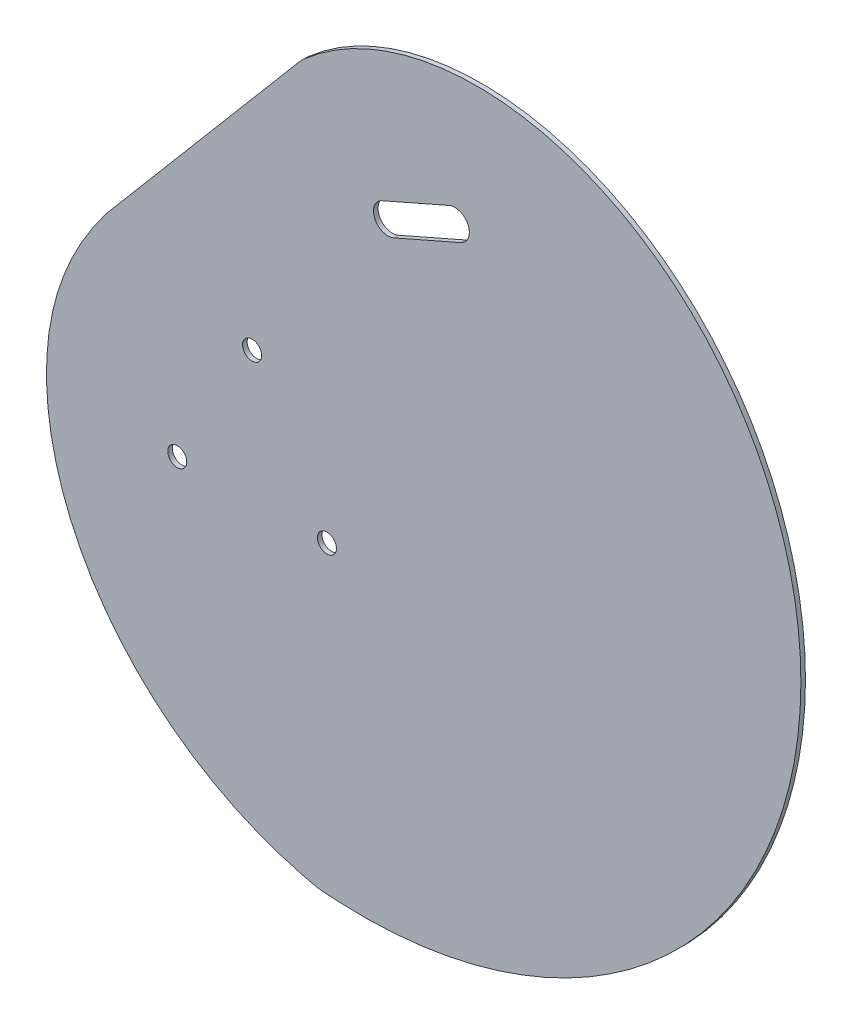
ISO-10303-21;
HEADER;
FILE_DESCRIPTION(('STEP AP214'),'2;1');
FILE_NAME('part.step','',(''),(''),'','','');
FILE_SCHEMA(('AUTOMOTIVE_DESIGN { 1 0 10303 214 1 1 1 1 }'));
ENDSEC;
DATA;
#1=APPLICATION_CONTEXT('core data for automotive mechanical design processes');
#2=APPLICATION_PROTOCOL_DEFINITION('international standard','automotive_design',2000,#1);
#3=PRODUCT_CONTEXT('',#1,'mechanical');
#4=PRODUCT('Part','Part','',(#3));
#5=PRODUCT_RELATED_PRODUCT_CATEGORY('part','',(#4));
#6=PRODUCT_DEFINITION_FORMATION('','',#4);
#7=PRODUCT_DEFINITION_CONTEXT('part definition',#1,'design');
#8=PRODUCT_DEFINITION('design','',#6,#7);
#9=PRODUCT_DEFINITION_SHAPE('','',#8);
#10=(LENGTH_UNIT() NAMED_UNIT(*) SI_UNIT(.MILLI.,.METRE.));
#11=(NAMED_UNIT(*) PLANE_ANGLE_UNIT() SI_UNIT($,.RADIAN.));
#12=(NAMED_UNIT(*) SI_UNIT($,.STERADIAN.) SOLID_ANGLE_UNIT());
#13=UNCERTAINTY_MEASURE_WITH_UNIT(LENGTH_MEASURE(1.E-05),#10,'distance_accuracy_value','');
#14=(GEOMETRIC_REPRESENTATION_CONTEXT(3) GLOBAL_UNCERTAINTY_ASSIGNED_CONTEXT((#13)) GLOBAL_UNIT_ASSIGNED_CONTEXT((#10,
#11,#12)) REPRESENTATION_CONTEXT('',''));
#15=CARTESIAN_POINT('',(0.,0.,0.));
#16=DIRECTION('',(0.,0.,1.));
#17=DIRECTION('',(1.,0.,0.));
#18=AXIS2_PLACEMENT_3D('',#15,#16,#17);
#19=CARTESIAN_POINT('',(0.,0.,0.396875));
#20=DIRECTION('',(0.,0.,1.));
#21=DIRECTION('',(1.,0.,0.));
#22=AXIS2_PLACEMENT_3D('',#19,#20,#21);
#23=PLANE('',#22);
#24=CARTESIAN_POINT('',(-12.5939001772955,-1.27258597502269,0.396875000000001));
#25=DIRECTION('',(0.,0.,1.));
#26=DIRECTION('',(1.,0.,0.));
#27=AXIS2_PLACEMENT_3D('',#24,#25,#26);
#28=CIRCLE('',#27,1.64999999999999);
#29=CARTESIAN_POINT('',(-10.9439001772955,-1.27258597502269,0.396875000000001));
#30=VERTEX_POINT('',#29);
#31=EDGE_CURVE('E114',#30,#30,#28,.T.);
#32=ORIENTED_EDGE('',*,*,#31,.F.);
#33=EDGE_LOOP('',(#32));
#34=FACE_BOUND('',#33,.T.);
#35=CARTESIAN_POINT('',(0.396480879471766,-23.7725859750223,0.396875000000001));
#36=DIRECTION('',(0.,0.,1.));
#37=DIRECTION('',(1.,0.,0.));
#38=AXIS2_PLACEMENT_3D('',#35,#36,#37);
#39=CIRCLE('',#38,1.64999999999999);
#40=CARTESIAN_POINT('',(2.04648087947175,-23.7725859750223,0.396875000000001));
#41=VERTEX_POINT('',#40);
#42=EDGE_CURVE('E157',#41,#41,#39,.T.);
#43=ORIENTED_EDGE('',*,*,#42,.F.);
#44=EDGE_LOOP('',(#43));
#45=FACE_BOUND('',#44,.T.);
#46=CARTESIAN_POINT('',(-25.5842812340614,-23.7725859750231,0.396875000000001));
#47=DIRECTION('',(0.,0.,1.));
#48=DIRECTION('',(1.,0.,0.));
#49=AXIS2_PLACEMENT_3D('',#46,#47,#48);
#50=CIRCLE('',#49,1.64999999999999);
#51=CARTESIAN_POINT('',(-23.9342812340614,-23.7725859750231,0.396875000000001));
#52=VERTEX_POINT('',#51);
#53=EDGE_CURVE('E164',#52,#52,#50,.T.);
#54=ORIENTED_EDGE('',*,*,#53,.F.);
#55=EDGE_LOOP('',(#54));
#56=FACE_BOUND('',#55,.T.);
#57=CARTESIAN_POINT('',(-1.26128431869605,-76.3889966640853,0.396875));
#58=CARTESIAN_POINT('',(-0.976706935574322,-76.433000958118,0.396875));
#59=CARTESIAN_POINT('',(-0.40570033732491,-76.5002886734785,0.396875));
#60=CARTESIAN_POINT('',(0.205282970299483,-76.5431286550552,0.396875));
#61=CARTESIAN_POINT('',(0.635947632892369,-76.5659234882829,0.396875));
#62=CARTESIAN_POINT('',(0.943803395898629,-76.5837536992732,0.396875));
#63=CARTESIAN_POINT('',(1.51657766798327,-76.6253526449032,0.396875));
#64=CARTESIAN_POINT('',(2.39472861708088,-76.6794226518138,0.396875));
#65=CARTESIAN_POINT('',(3.1808192769605,-76.7137003743502,0.396875));
#66=CARTESIAN_POINT('',(4.19803699961454,-76.75168724619,0.396875));
#67=CARTESIAN_POINT('',(6.0521406389918,-76.7942720929503,0.396875));
#68=CARTESIAN_POINT('',(8.65531896727179,-76.7757899651055,0.396875));
#69=CARTESIAN_POINT('',(11.7992302850273,-76.631186753929,0.396875));
#70=CARTESIAN_POINT('',(14.9308116076091,-76.362150817123,0.396875));
#71=CARTESIAN_POINT('',(19.0927292822368,-75.8376989684194,0.396875));
#72=CARTESIAN_POINT('',(24.2526003043896,-74.8709042385839,0.396875));
#73=CARTESIAN_POINT('',(30.3366917936986,-73.2151665179252,0.396875));
#74=CARTESIAN_POINT('',(38.2496377184228,-70.3553029330726,0.396875));
#75=CARTESIAN_POINT('',(47.6646576679233,-65.5807106727296,0.396875));
#76=CARTESIAN_POINT('',(57.8782405742599,-58.0526588499173,0.396875));
#77=CARTESIAN_POINT('',(69.6472472290832,-45.8604490127679,0.396875));
#78=CARTESIAN_POINT('',(80.1730162895738,-27.1334514768673,0.396875));
#79=CARTESIAN_POINT('',(84.2538630410436,-1.50479165459522,0.396875));
#80=CARTESIAN_POINT('',(79.5599947434369,19.8412067482863,0.396875));
#81=CARTESIAN_POINT('',(70.8796865135484,34.9401638956233,0.396875));
#82=CARTESIAN_POINT('',(62.021642873432,44.7053655266334,0.396875));
#83=CARTESIAN_POINT('',(51.0907411074019,52.2640812116842,0.396875));
#84=CARTESIAN_POINT('',(38.576471746608,57.0540859282341,0.396875));
#85=CARTESIAN_POINT('',(25.1004774931715,58.5603822983813,0.396875));
#86=CARTESIAN_POINT('',(13.7708368946147,56.6943293928139,0.396875));
#87=CARTESIAN_POINT('',(5.22574400857566,53.179291685644,0.396875));
#88=CARTESIAN_POINT('',(-0.75748548654271,49.5274645181489,0.396875));
#89=CARTESIAN_POINT('',(-5.17982564226412,45.6481332259453,0.396875));
#90=CARTESIAN_POINT('',(-8.21712868273601,42.3111233056651,0.396875));
#91=CARTESIAN_POINT('',(-10.2837476793927,39.7285564460287,0.396875));
#92=CARTESIAN_POINT('',(-12.1453981413637,37.1299230221057,0.396875));
#93=CARTESIAN_POINT('',(-13.803593656072,34.6302202411006,0.396875));
#94=CARTESIAN_POINT('',(-15.0263666385234,32.7872172676154,0.396875));
#95=CARTESIAN_POINT('',(-15.757749026262,31.8150435741405,0.396875));
#96=CARTESIAN_POINT('',(-16.4572837085939,31.0087975471452,0.396875));
#97=CARTESIAN_POINT('',(-17.3148530430872,30.2124256121384,0.396875));
#98=CARTESIAN_POINT('',(-18.8320987171928,29.1405411562789,0.396875));
#99=CARTESIAN_POINT('',(-20.5794335453912,27.9210149954297,0.396875));
#100=CARTESIAN_POINT('',(-21.8514483213816,26.9528121584477,0.396875));
#101=CARTESIAN_POINT('',(-22.9229134864311,26.0255763335065,0.396875));
#102=CARTESIAN_POINT('',(-23.9113330049711,25.0957745743073,0.396875));
#103=CARTESIAN_POINT('',(-25.0438847891512,23.9057178105531,0.396875));
#104=CARTESIAN_POINT('',(-26.2444451597005,22.4769501418682,0.396875));
#105=CARTESIAN_POINT('',(-27.6678771544237,20.6032078316902,0.396875));
#106=CARTESIAN_POINT('',(-29.1662720153948,18.3817060593167,0.396875));
#107=CARTESIAN_POINT('',(-30.6820035254275,16.0304898055358,0.396875));
#108=CARTESIAN_POINT('',(-31.8417450158577,14.3234191557175,0.396875));
#109=CARTESIAN_POINT('',(-32.7929265221825,13.0258719381619,0.396875));
#110=CARTESIAN_POINT('',(-33.7609917005133,11.7717771176703,0.396875));
#111=CARTESIAN_POINT('',(-35.1935179417244,10.0318274989824,0.396875));
#112=CARTESIAN_POINT('',(-37.0947743542895,7.68858611063458,0.396875));
#113=CARTESIAN_POINT('',(-39.6505131759334,4.30610185058949,0.396875));
#114=CARTESIAN_POINT('',(-42.6514237523282,-0.366044153239744,0.396875));
#115=CARTESIAN_POINT('',(-45.5355557594005,-6.54725137287064,0.396875));
#116=CARTESIAN_POINT('',(-47.5029702487626,-13.2116577754802,0.396875));
#117=CARTESIAN_POINT('',(-48.6844974640878,-22.3699096817478,0.396875));
#118=CARTESIAN_POINT('',(-47.6098868039418,-33.7322087237693,0.396875));
#119=CARTESIAN_POINT('',(-42.8642408139455,-46.3451326435725,0.396875));
#120=CARTESIAN_POINT('',(-36.5641298213063,-55.4680273522898,0.396875));
#121=CARTESIAN_POINT('',(-30.4296575788591,-61.7275262732319,0.396875));
#122=CARTESIAN_POINT('',(-25.3568115028753,-65.8672301951248,0.396875));
#123=CARTESIAN_POINT('',(-20.7978951820845,-68.8298585097831,0.396875));
#124=CARTESIAN_POINT('',(-16.9868888228126,-70.8972783811654,0.396875));
#125=CARTESIAN_POINT('',(-14.0571261532245,-72.2940624730244,0.396875));
#126=CARTESIAN_POINT('',(-11.0574897827893,-73.537247470639,0.396875));
#127=CARTESIAN_POINT('',(-8.52863978148638,-74.4382486629739,0.396875));
#128=CARTESIAN_POINT('',(-6.7053553577977,-75.0088395123344,0.396875));
#129=CARTESIAN_POINT('',(-5.69991861950379,-75.3033007427362,0.396875));
#130=CARTESIAN_POINT('',(-4.91466346108121,-75.5253296610727,0.396875));
#131=CARTESIAN_POINT('',(-4.04372816904597,-75.7517503026063,0.396875));
#132=CARTESIAN_POINT('',(-3.47701846483031,-75.8911528901832,0.396875));
#133=CARTESIAN_POINT('',(-3.15620305968882,-75.9746877031505,0.396875));
#134=CARTESIAN_POINT('',(-2.71872815087296,-76.0895979552755,0.396875));
#135=CARTESIAN_POINT('',(-2.11316463605528,-76.2362629092826,0.396875));
#136=CARTESIAN_POINT('',(-1.54586170181775,-76.3449923700527,0.396875));
#137=CARTESIAN_POINT('',(-1.26128431869605,-76.3889966640853,0.396875));
#138=B_SPLINE_CURVE_WITH_KNOTS('',3,(#57,#58,#59,#60,#61,#62,#63,#64,#65,#66,#67,#68,#69,#70,
#71,#72,#73,#74,#75,#76,#77,#78,#79,#80,#81,#82,#83,#84,#85,#86,#87,#88,#89,#90,#91,#92,#93,#94,
#95,#96,#97,#98,#99,#100,#101,#102,#103,#104,#105,#106,#107,#108,#109,#110,#111,#112,#113,#114,
#115,#116,#117,#118,#119,#120,#121,#122,#123,#124,#125,#126,#127,#128,#129,#130,#131,#132,#133,
#134,#135,#136,#137),.UNSPECIFIED.,.T.,.F.,(4,1,1,1,1,1,1,1,1,1,1,1,1,1,1,1,1,1,1,1,1,1,1,1,1,1,
1,1,1,1,1,1,1,1,1,1,1,1,1,1,1,1,1,1,1,1,1,1,1,1,1,1,1,1,1,1,1,1,1,1,1,1,1,1,1,1,1,1,1,1,1,1,1,1,
1,1,1,1,4),(0.,0.0009765625,0.001953125,0.0029296875,0.00390625,0.005859375,0.0078125,
0.009765625,0.01171875,0.015625,0.0234375,0.03125,0.0390625,0.046875,0.0625,0.078125,0.09375,
0.125,0.15625,0.1875,0.25,0.3125,0.375,0.40625,0.4375,0.46875,0.5,0.53125,0.5625,0.578125,
0.59375,0.609375,0.6171875,0.625,0.6328125,0.640625,0.6484375,0.65234375,0.65625,0.6640625,
0.671875,0.67578125,0.6796875,0.681640625,0.68359375,0.6875,0.69140625,0.6953125,0.703125,
0.7109375,0.71875,0.72265625,0.7265625,0.734375,0.7421875,0.75,0.765625,0.78125,0.796875,0.8125,
0.84375,0.875,0.90625,0.921875,0.9375,0.953125,0.9609375,0.96875,0.9765625,0.984375,0.98828125,
0.990234375,0.9921875,0.994140625,0.99609375,0.9970703125,0.998046875,0.9990234375,1.),.UNSPECIFIED.);
#139=CARTESIAN_POINT('',(-37.9799857120954,6.50792390325195,0.396875));
#140=VERTEX_POINT('',#139);
#141=CARTESIAN_POINT('',(-3.53695857470606,47.0282576025844,0.396875));
#142=VERTEX_POINT('',#141);
#143=EDGE_CURVE('E179',#140,#142,#138,.T.);
#144=ORIENTED_EDGE('',*,*,#143,.T.);
#145=CARTESIAN_POINT('',(3.06845796283441,39.5203635992312,0.396875));
#146=DIRECTION('',(0.,0.,1.));
#147=DIRECTION('',(1.,0.,0.));
#148=AXIS2_PLACEMENT_3D('',#145,#146,#147);
#149=CIRCLE('',#148,10.);
#150=CARTESIAN_POINT('',(-4.56394467477297,45.9815113283459,0.396875));
#151=VERTEX_POINT('',#150);
#152=EDGE_CURVE('E197',#142,#151,#149,.T.);
#153=ORIENTED_EDGE('',*,*,#152,.T.);
#154=DIRECTION('',(0.64611477291147,0.763240263760737,0.));
#155=VECTOR('',#154,1.);
#156=CARTESIAN_POINT('',(-4.11931026186588,46.506747556973,0.396875));
#157=LINE('',#156,#155);
#158=EDGE_CURVE('E171',#140,#151,#157,.T.);
#159=ORIENTED_EDGE('',*,*,#158,.F.);
#160=EDGE_LOOP('',(#144,#153,#159));
#161=FACE_BOUND('',#160,.T.);
#162=DIRECTION('',(0.915739274242188,0.401773047391671,0.));
#163=VECTOR('',#162,1.);
#164=CARTESIAN_POINT('',(11.9849141806537,27.8957335836621,0.396875000000001));
#165=LINE('',#164,#163);
#166=CARTESIAN_POINT('',(11.9849141806537,27.8957335836621,0.396875000000001));
#167=VERTEX_POINT('',#166);
#168=CARTESIAN_POINT('',(23.6148029635294,32.9982512855363,0.396875000000001));
#169=VERTEX_POINT('',#168);
#170=EDGE_CURVE('E106',#167,#169,#165,.T.);
#171=ORIENTED_EDGE('',*,*,#170,.F.);
#172=CARTESIAN_POINT('',(10.9804815621745,30.1850817692675,0.396875000000001));
#173=DIRECTION('',(0.,0.,1.));
#174=DIRECTION('',(1.,0.,0.));
#175=AXIS2_PLACEMENT_3D('',#172,#173,#174);
#176=CIRCLE('',#175,2.5);
#177=CARTESIAN_POINT('',(9.97604894369531,32.474429954873,0.396875000000001));
#178=VERTEX_POINT('',#177);
#179=EDGE_CURVE('E97',#178,#167,#176,.T.);
#180=ORIENTED_EDGE('',*,*,#179,.F.);
#181=DIRECTION('',(-0.915739274242188,-0.401773047391673,0.));
#182=VECTOR('',#181,1.);
#183=CARTESIAN_POINT('',(9.97604894369531,32.474429954873,0.396875000000001));
#184=LINE('',#183,#182);
#185=CARTESIAN_POINT('',(21.6059377265711,37.5769476567472,0.396875));
#186=VERTEX_POINT('',#185);
#187=EDGE_CURVE('E123',#186,#178,#184,.T.);
#188=ORIENTED_EDGE('',*,*,#187,.F.);
#189=CARTESIAN_POINT('',(22.6103703450502,35.2875994711417,0.396875000000001));
#190=DIRECTION('',(0.,0.,1.));
#191=DIRECTION('',(1.,0.,0.));
#192=AXIS2_PLACEMENT_3D('',#189,#190,#191);
#193=CIRCLE('',#192,2.50000000000002);
#194=EDGE_CURVE('E118',#169,#186,#193,.T.);
#195=ORIENTED_EDGE('',*,*,#194,.F.);
#196=EDGE_LOOP('',(#171,#180,#188,#195));
#197=FACE_BOUND('',#196,.T.);
#198=ADVANCED_FACE('F39',(#34,#45,#56,#161,#197),#23,.T.);
#199=CARTESIAN_POINT('',(0.,0.,-0.396875));
#200=DIRECTION('',(0.,0.,1.));
#201=DIRECTION('',(1.,0.,0.));
#202=AXIS2_PLACEMENT_3D('',#199,#200,#201);
#203=PLANE('',#202);
#204=DIRECTION('',(0.64611477291147,0.763240263760737,0.));
#205=VECTOR('',#204,1.);
#206=CARTESIAN_POINT('',(-25.3340204344462,21.4463068015867,-0.396875));
#207=LINE('',#206,#205);
#208=CARTESIAN_POINT('',(-37.9799857120954,6.50792390325195,-0.396875));
#209=VERTEX_POINT('',#208);
#210=CARTESIAN_POINT('',(-4.56394467477297,45.9815113283459,-0.396875));
#211=VERTEX_POINT('',#210);
#212=EDGE_CURVE('E186',#209,#211,#207,.T.);
#213=ORIENTED_EDGE('',*,*,#212,.T.);
#214=CARTESIAN_POINT('',(3.06845796283441,39.5203635992312,-0.396875));
#215=DIRECTION('',(0.,0.,1.));
#216=DIRECTION('',(1.,0.,0.));
#217=AXIS2_PLACEMENT_3D('',#214,#215,#216);
#218=CIRCLE('',#217,10.);
#219=CARTESIAN_POINT('',(-3.53695857470606,47.0282576025844,-0.396875));
#220=VERTEX_POINT('',#219);
#221=EDGE_CURVE('E12',#211,#220,#218,.F.);
#222=ORIENTED_EDGE('',*,*,#221,.T.);
#223=CARTESIAN_POINT('',(-1.26128431869605,-76.3889966640853,-0.396875));
#224=CARTESIAN_POINT('',(-0.976706935574322,-76.433000958118,-0.396875));
#225=CARTESIAN_POINT('',(-0.40570033732491,-76.5002886734785,-0.396875));
#226=CARTESIAN_POINT('',(0.205282970299483,-76.5431286550552,-0.396875));
#227=CARTESIAN_POINT('',(0.635947632892369,-76.5659234882829,-0.396875));
#228=CARTESIAN_POINT('',(0.943803395898629,-76.5837536992732,-0.396875));
#229=CARTESIAN_POINT('',(1.51657766798327,-76.6253526449032,-0.396875));
#230=CARTESIAN_POINT('',(2.39472861708088,-76.6794226518138,-0.396875));
#231=CARTESIAN_POINT('',(3.1808192769605,-76.7137003743502,-0.396875));
#232=CARTESIAN_POINT('',(4.19803699961454,-76.75168724619,-0.396875));
#233=CARTESIAN_POINT('',(6.0521406389918,-76.7942720929503,-0.396875));
#234=CARTESIAN_POINT('',(8.65531896727179,-76.7757899651055,-0.396875));
#235=CARTESIAN_POINT('',(11.7992302850273,-76.631186753929,-0.396875));
#236=CARTESIAN_POINT('',(14.9308116076091,-76.362150817123,-0.396875));
#237=CARTESIAN_POINT('',(19.0927292822368,-75.8376989684194,-0.396875));
#238=CARTESIAN_POINT('',(24.2526003043896,-74.8709042385839,-0.396875));
#239=CARTESIAN_POINT('',(30.3366917936986,-73.2151665179252,-0.396875));
#240=CARTESIAN_POINT('',(38.2496377184228,-70.3553029330726,-0.396875));
#241=CARTESIAN_POINT('',(47.6646576679233,-65.5807106727296,-0.396875));
#242=CARTESIAN_POINT('',(57.8782405742599,-58.0526588499173,-0.396875));
#243=CARTESIAN_POINT('',(69.6472472290832,-45.8604490127679,-0.396875));
#244=CARTESIAN_POINT('',(80.1730162895738,-27.1334514768673,-0.396875));
#245=CARTESIAN_POINT('',(84.2538630410436,-1.50479165459522,-0.396875));
#246=CARTESIAN_POINT('',(79.5599947434369,19.8412067482863,-0.396875));
#247=CARTESIAN_POINT('',(70.8796865135484,34.9401638956233,-0.396875));
#248=CARTESIAN_POINT('',(62.021642873432,44.7053655266334,-0.396875));
#249=CARTESIAN_POINT('',(51.0907411074019,52.2640812116842,-0.396875));
#250=CARTESIAN_POINT('',(38.576471746608,57.0540859282341,-0.396875));
#251=CARTESIAN_POINT('',(25.1004774931715,58.5603822983813,-0.396875));
#252=CARTESIAN_POINT('',(13.7708368946147,56.6943293928139,-0.396875));
#253=CARTESIAN_POINT('',(5.22574400857566,53.179291685644,-0.396875));
#254=CARTESIAN_POINT('',(-0.75748548654271,49.5274645181489,-0.396875));
#255=CARTESIAN_POINT('',(-5.17982564226412,45.6481332259453,-0.396875));
#256=CARTESIAN_POINT('',(-8.21712868273601,42.3111233056651,-0.396875));
#257=CARTESIAN_POINT('',(-10.2837476793927,39.7285564460287,-0.396875));
#258=CARTESIAN_POINT('',(-12.1453981413637,37.1299230221057,-0.396875));
#259=CARTESIAN_POINT('',(-13.803593656072,34.6302202411006,-0.396875));
#260=CARTESIAN_POINT('',(-15.0263666385234,32.7872172676154,-0.396875));
#261=CARTESIAN_POINT('',(-15.757749026262,31.8150435741405,-0.396875));
#262=CARTESIAN_POINT('',(-16.4572837085939,31.0087975471452,-0.396875));
#263=CARTESIAN_POINT('',(-17.3148530430872,30.2124256121384,-0.396875));
#264=CARTESIAN_POINT('',(-18.8320987171928,29.1405411562789,-0.396875));
#265=CARTESIAN_POINT('',(-20.5794335453912,27.9210149954297,-0.396875));
#266=CARTESIAN_POINT('',(-21.8514483213816,26.9528121584477,-0.396875));
#267=CARTESIAN_POINT('',(-22.9229134864311,26.0255763335065,-0.396875));
#268=CARTESIAN_POINT('',(-23.9113330049711,25.0957745743073,-0.396875));
#269=CARTESIAN_POINT('',(-25.0438847891512,23.9057178105531,-0.396875));
#270=CARTESIAN_POINT('',(-26.2444451597005,22.4769501418682,-0.396875));
#271=CARTESIAN_POINT('',(-27.6678771544237,20.6032078316902,-0.396875));
#272=CARTESIAN_POINT('',(-29.1662720153948,18.3817060593167,-0.396875));
#273=CARTESIAN_POINT('',(-30.6820035254275,16.0304898055358,-0.396875));
#274=CARTESIAN_POINT('',(-31.8417450158577,14.3234191557175,-0.396875));
#275=CARTESIAN_POINT('',(-32.7929265221825,13.0258719381619,-0.396875));
#276=CARTESIAN_POINT('',(-33.7609917005133,11.7717771176703,-0.396875));
#277=CARTESIAN_POINT('',(-35.1935179417244,10.0318274989824,-0.396875));
#278=CARTESIAN_POINT('',(-37.0947743542895,7.68858611063458,-0.396875));
#279=CARTESIAN_POINT('',(-39.6505131759334,4.30610185058949,-0.396875));
#280=CARTESIAN_POINT('',(-42.6514237523282,-0.366044153239744,-0.396875));
#281=CARTESIAN_POINT('',(-45.5355557594005,-6.54725137287064,-0.396875));
#282=CARTESIAN_POINT('',(-47.5029702487626,-13.2116577754802,-0.396875));
#283=CARTESIAN_POINT('',(-48.6844974640878,-22.3699096817478,-0.396875));
#284=CARTESIAN_POINT('',(-47.6098868039418,-33.7322087237693,-0.396875));
#285=CARTESIAN_POINT('',(-42.8642408139455,-46.3451326435725,-0.396875));
#286=CARTESIAN_POINT('',(-36.5641298213063,-55.4680273522898,-0.396875));
#287=CARTESIAN_POINT('',(-30.4296575788591,-61.7275262732319,-0.396875));
#288=CARTESIAN_POINT('',(-25.3568115028753,-65.8672301951248,-0.396875));
#289=CARTESIAN_POINT('',(-20.7978951820845,-68.8298585097831,-0.396875));
#290=CARTESIAN_POINT('',(-16.9868888228126,-70.8972783811654,-0.396875));
#291=CARTESIAN_POINT('',(-14.0571261532245,-72.2940624730244,-0.396875));
#292=CARTESIAN_POINT('',(-11.0574897827893,-73.537247470639,-0.396875));
#293=CARTESIAN_POINT('',(-8.52863978148638,-74.4382486629739,-0.396875));
#294=CARTESIAN_POINT('',(-6.7053553577977,-75.0088395123344,-0.396875));
#295=CARTESIAN_POINT('',(-5.69991861950379,-75.3033007427362,-0.396875));
#296=CARTESIAN_POINT('',(-4.91466346108121,-75.5253296610727,-0.396875));
#297=CARTESIAN_POINT('',(-4.04372816904597,-75.7517503026063,-0.396875));
#298=CARTESIAN_POINT('',(-3.47701846483031,-75.8911528901832,-0.396875));
#299=CARTESIAN_POINT('',(-3.15620305968882,-75.9746877031505,-0.396875));
#300=CARTESIAN_POINT('',(-2.71872815087296,-76.0895979552755,-0.396875));
#301=CARTESIAN_POINT('',(-2.11316463605528,-76.2362629092826,-0.396875));
#302=CARTESIAN_POINT('',(-1.54586170181775,-76.3449923700527,-0.396875));
#303=CARTESIAN_POINT('',(-1.26128431869605,-76.3889966640853,-0.396875));
#304=B_SPLINE_CURVE_WITH_KNOTS('',3,(#223,#224,#225,#226,#227,#228,#229,#230,#231,#232,#233,
#234,#235,#236,#237,#238,#239,#240,#241,#242,#243,#244,#245,#246,#247,#248,#249,#250,#251,#252,
#253,#254,#255,#256,#257,#258,#259,#260,#261,#262,#263,#264,#265,#266,#267,#268,#269,#270,#271,
#272,#273,#274,#275,#276,#277,#278,#279,#280,#281,#282,#283,#284,#285,#286,#287,#288,#289,#290,
#291,#292,#293,#294,#295,#296,#297,#298,#299,#300,#301,#302,#303),.UNSPECIFIED.,.T.,.F.,(4,1,1,
1,1,1,1,1,1,1,1,1,1,1,1,1,1,1,1,1,1,1,1,1,1,1,1,1,1,1,1,1,1,1,1,1,1,1,1,1,1,1,1,1,1,1,1,1,1,1,1,
1,1,1,1,1,1,1,1,1,1,1,1,1,1,1,1,1,1,1,1,1,1,1,1,1,1,1,4),(0.,0.0009765625,0.001953125,
0.0029296875,0.00390625,0.005859375,0.0078125,0.009765625,0.01171875,0.015625,0.0234375,0.03125,
0.0390625,0.046875,0.0625,0.078125,0.09375,0.125,0.15625,0.1875,0.25,0.3125,0.375,0.40625,
0.4375,0.46875,0.5,0.53125,0.5625,0.578125,0.59375,0.609375,0.6171875,0.625,0.6328125,0.640625,
0.6484375,0.65234375,0.65625,0.6640625,0.671875,0.67578125,0.6796875,0.681640625,0.68359375,
0.6875,0.69140625,0.6953125,0.703125,0.7109375,0.71875,0.72265625,0.7265625,0.734375,0.7421875,
0.75,0.765625,0.78125,0.796875,0.8125,0.84375,0.875,0.90625,0.921875,0.9375,0.953125,0.9609375,
0.96875,0.9765625,0.984375,0.98828125,0.990234375,0.9921875,0.994140625,0.99609375,0.9970703125,
0.998046875,0.9990234375,1.),.UNSPECIFIED.);
#305=EDGE_CURVE('E178',#209,#220,#304,.T.);
#306=ORIENTED_EDGE('',*,*,#305,.F.);
#307=EDGE_LOOP('',(#213,#222,#306));
#308=FACE_BOUND('',#307,.T.);
#309=CARTESIAN_POINT('',(-25.5842812340614,-23.7725859750231,-0.396875));
#310=DIRECTION('',(0.,0.,1.));
#311=DIRECTION('',(1.,0.,0.));
#312=AXIS2_PLACEMENT_3D('',#309,#310,#311);
#313=CIRCLE('',#312,1.65);
#314=CARTESIAN_POINT('',(-23.9342812340614,-23.7725859750231,-0.396875));
#315=VERTEX_POINT('',#314);
#316=EDGE_CURVE('E169',#315,#315,#313,.T.);
#317=ORIENTED_EDGE('',*,*,#316,.T.);
#318=EDGE_LOOP('',(#317));
#319=FACE_BOUND('',#318,.T.);
#320=CARTESIAN_POINT('',(0.396480879471766,-23.7725859750223,-0.396875));
#321=DIRECTION('',(0.,0.,1.));
#322=DIRECTION('',(1.,0.,0.));
#323=AXIS2_PLACEMENT_3D('',#320,#321,#322);
#324=CIRCLE('',#323,1.65);
#325=CARTESIAN_POINT('',(2.04648087947176,-23.7725859750223,-0.396875));
#326=VERTEX_POINT('',#325);
#327=EDGE_CURVE('E162',#326,#326,#324,.T.);
#328=ORIENTED_EDGE('',*,*,#327,.T.);
#329=EDGE_LOOP('',(#328));
#330=FACE_BOUND('',#329,.T.);
#331=CARTESIAN_POINT('',(-12.5939001772955,-1.27258597502269,-0.396875));
#332=DIRECTION('',(0.,0.,1.));
#333=DIRECTION('',(1.,0.,0.));
#334=AXIS2_PLACEMENT_3D('',#331,#332,#333);
#335=CIRCLE('',#334,1.65);
#336=CARTESIAN_POINT('',(-10.9439001772955,-1.27258597502269,-0.396875));
#337=VERTEX_POINT('',#336);
#338=EDGE_CURVE('E150',#337,#337,#335,.T.);
#339=ORIENTED_EDGE('',*,*,#338,.T.);
#340=EDGE_LOOP('',(#339));
#341=FACE_BOUND('',#340,.T.);
#342=CARTESIAN_POINT('',(10.9804815621745,30.1850817692675,-0.396874999999852));
#343=DIRECTION('',(0.,0.,1.));
#344=DIRECTION('',(1.,0.,0.));
#345=AXIS2_PLACEMENT_3D('',#342,#343,#344);
#346=CIRCLE('',#345,2.5);
#347=CARTESIAN_POINT('',(9.97604894369531,32.474429954873,-0.396875));
#348=VERTEX_POINT('',#347);
#349=CARTESIAN_POINT('',(11.9849141806537,27.8957335836621,-0.396874999999852));
#350=VERTEX_POINT('',#349);
#351=EDGE_CURVE('E62',#348,#350,#346,.T.);
#352=ORIENTED_EDGE('',*,*,#351,.T.);
#353=DIRECTION('',(0.915739274242188,0.401773047391671,0.));
#354=VECTOR('',#353,1.);
#355=CARTESIAN_POINT('',(11.9849141806537,27.8957335836621,-0.396874999999852));
#356=LINE('',#355,#354);
#357=CARTESIAN_POINT('',(23.6148029635294,32.9982512855363,-0.396874999999852));
#358=VERTEX_POINT('',#357);
#359=EDGE_CURVE('E113',#350,#358,#356,.T.);
#360=ORIENTED_EDGE('',*,*,#359,.T.);
#361=CARTESIAN_POINT('',(22.6103703450502,35.2875994711417,-0.396874999999852));
#362=DIRECTION('',(0.,0.,1.));
#363=DIRECTION('',(1.,0.,0.));
#364=AXIS2_PLACEMENT_3D('',#361,#362,#363);
#365=CIRCLE('',#364,2.50000000000002);
#366=CARTESIAN_POINT('',(21.6059377265711,37.5769476567472,-0.396874999999852));
#367=VERTEX_POINT('',#366);
#368=EDGE_CURVE('E138',#358,#367,#365,.T.);
#369=ORIENTED_EDGE('',*,*,#368,.T.);
#370=DIRECTION('',(-0.915739274242188,-0.401773047391673,0.));
#371=VECTOR('',#370,1.);
#372=CARTESIAN_POINT('',(9.97604894369531,32.474429954873,-0.396874999999852));
#373=LINE('',#372,#371);
#374=EDGE_CURVE('E107',#367,#348,#373,.T.);
#375=ORIENTED_EDGE('',*,*,#374,.T.);
#376=EDGE_LOOP('',(#352,#360,#369,#375));
#377=FACE_BOUND('',#376,.T.);
#378=ADVANCED_FACE('F211',(#308,#319,#330,#341,#377),#203,.F.);
#379=DIRECTION('',(0.,0.,-1.));
#380=VECTOR('',#379,1.);
#381=SURFACE_OF_LINEAR_EXTRUSION('',#138,#380);
#382=ORIENTED_EDGE('',*,*,#305,.T.);
#383=DIRECTION('',(0.,0.,-1.));
#384=VECTOR('',#383,1.);
#385=CARTESIAN_POINT('',(-3.53695857470606,47.0282576025844,-0.396875));
#386=LINE('',#385,#384);
#387=EDGE_CURVE('E201',#220,#142,#386,.F.);
#388=ORIENTED_EDGE('',*,*,#387,.T.);
#389=ORIENTED_EDGE('',*,*,#143,.F.);
#390=DIRECTION('',(0.,0.,1.));
#391=VECTOR('',#390,1.);
#392=CARTESIAN_POINT('',(-37.9799857120954,6.50792390325195,-0.396875));
#393=LINE('',#392,#391);
#394=EDGE_CURVE('E175',#209,#140,#393,.T.);
#395=ORIENTED_EDGE('',*,*,#394,.F.);
#396=EDGE_LOOP('',(#382,#388,#389,#395));
#397=FACE_BOUND('',#396,.T.);
#398=ADVANCED_FACE('F194',(#397),#381,.F.);
#399=CARTESIAN_POINT('',(-4.11931026186588,46.506747556973,-0.396875));
#400=DIRECTION('',(0.763240263760737,-0.64611477291147,0.));
#401=DIRECTION('',(0.64611477291147,0.763240263760737,0.));
#402=AXIS2_PLACEMENT_3D('',#399,#400,#401);
#403=PLANE('',#402);
#404=ORIENTED_EDGE('',*,*,#158,.T.);
#405=DIRECTION('',(0.,0.,-1.));
#406=VECTOR('',#405,1.);
#407=CARTESIAN_POINT('',(-4.56394467477297,45.9815113283459,-0.396875));
#408=LINE('',#407,#406);
#409=EDGE_CURVE('E47',#151,#211,#408,.T.);
#410=ORIENTED_EDGE('',*,*,#409,.T.);
#411=ORIENTED_EDGE('',*,*,#212,.F.);
#412=ORIENTED_EDGE('',*,*,#394,.T.);
#413=EDGE_LOOP('',(#404,#410,#411,#412));
#414=FACE_BOUND('',#413,.T.);
#415=ADVANCED_FACE('F205',(#414),#403,.F.);
#416=CARTESIAN_POINT('',(-25.5842812340614,-23.7725859750231,0.396875));
#417=DIRECTION('',(0.,0.,1.));
#418=DIRECTION('',(1.,0.,0.));
#419=AXIS2_PLACEMENT_3D('',#416,#417,#418);
#420=CYLINDRICAL_SURFACE('',#419,1.64999999999999);
#421=ORIENTED_EDGE('',*,*,#316,.F.);
#422=EDGE_LOOP('',(#421));
#423=FACE_BOUND('',#422,.T.);
#424=ORIENTED_EDGE('',*,*,#53,.T.);
#425=EDGE_LOOP('',(#424));
#426=FACE_BOUND('',#425,.T.);
#427=ADVANCED_FACE('F230',(#423,#426),#420,.F.);
#428=CARTESIAN_POINT('',(0.396480879471766,-23.7725859750223,0.396875));
#429=DIRECTION('',(0.,0.,1.));
#430=DIRECTION('',(1.,0.,0.));
#431=AXIS2_PLACEMENT_3D('',#428,#429,#430);
#432=CYLINDRICAL_SURFACE('',#431,1.64999999999999);
#433=ORIENTED_EDGE('',*,*,#327,.F.);
#434=EDGE_LOOP('',(#433));
#435=FACE_BOUND('',#434,.T.);
#436=ORIENTED_EDGE('',*,*,#42,.T.);
#437=EDGE_LOOP('',(#436));
#438=FACE_BOUND('',#437,.T.);
#439=ADVANCED_FACE('F233',(#435,#438),#432,.F.);
#440=CARTESIAN_POINT('',(-12.5939001772955,-1.27258597502269,0.396875));
#441=DIRECTION('',(0.,0.,1.));
#442=DIRECTION('',(1.,0.,0.));
#443=AXIS2_PLACEMENT_3D('',#440,#441,#442);
#444=CYLINDRICAL_SURFACE('',#443,1.64999999999999);
#445=ORIENTED_EDGE('',*,*,#338,.F.);
#446=EDGE_LOOP('',(#445));
#447=FACE_BOUND('',#446,.T.);
#448=ORIENTED_EDGE('',*,*,#31,.T.);
#449=EDGE_LOOP('',(#448));
#450=FACE_BOUND('',#449,.T.);
#451=ADVANCED_FACE('F237',(#447,#450),#444,.F.);
#452=CARTESIAN_POINT('',(3.06845796283441,39.5203635992312,0.));
#453=DIRECTION('',(0.,0.,-1.));
#454=DIRECTION('',(-1.,0.,0.));
#455=AXIS2_PLACEMENT_3D('',#452,#453,#454);
#456=CYLINDRICAL_SURFACE('',#455,10.);
#457=ORIENTED_EDGE('',*,*,#221,.F.);
#458=ORIENTED_EDGE('',*,*,#409,.F.);
#459=ORIENTED_EDGE('',*,*,#152,.F.);
#460=ORIENTED_EDGE('',*,*,#387,.F.);
#461=EDGE_LOOP('',(#457,#458,#459,#460));
#462=FACE_BOUND('',#461,.T.);
#463=ADVANCED_FACE('F41',(#462),#456,.T.);
#464=CARTESIAN_POINT('',(10.9804815621745,30.1850817692675,0.396875000000001));
#465=DIRECTION('',(0.,0.,-1.));
#466=DIRECTION('',(-1.,0.,0.));
#467=AXIS2_PLACEMENT_3D('',#464,#465,#466);
#468=CYLINDRICAL_SURFACE('',#467,2.5);
#469=ORIENTED_EDGE('',*,*,#351,.F.);
#470=DIRECTION('',(0.,0.,-1.));
#471=VECTOR('',#470,1.);
#472=CARTESIAN_POINT('',(9.97604894369531,32.474429954873,0.396875000000001));
#473=LINE('',#472,#471);
#474=EDGE_CURVE('E101',#178,#348,#473,.T.);
#475=ORIENTED_EDGE('',*,*,#474,.F.);
#476=ORIENTED_EDGE('',*,*,#179,.T.);
#477=DIRECTION('',(0.,0.,-1.));
#478=VECTOR('',#477,1.);
#479=CARTESIAN_POINT('',(11.9849141806537,27.8957335836621,0.396875000000001));
#480=LINE('',#479,#478);
#481=EDGE_CURVE('E100',#167,#350,#480,.T.);
#482=ORIENTED_EDGE('',*,*,#481,.T.);
#483=EDGE_LOOP('',(#469,#475,#476,#482));
#484=FACE_BOUND('',#483,.T.);
#485=ADVANCED_FACE('F99',(#484),#468,.F.);
#486=CARTESIAN_POINT('',(11.9849141806537,27.8957335836621,0.396875000000001));
#487=DIRECTION('',(-0.401773047391671,0.915739274242189,0.));
#488=DIRECTION('',(-0.915739274242189,-0.401773047391671,0.));
#489=AXIS2_PLACEMENT_3D('',#486,#487,#488);
#490=PLANE('',#489);
#491=ORIENTED_EDGE('',*,*,#359,.F.);
#492=ORIENTED_EDGE('',*,*,#481,.F.);
#493=ORIENTED_EDGE('',*,*,#170,.T.);
#494=DIRECTION('',(0.,0.,-1.));
#495=VECTOR('',#494,1.);
#496=CARTESIAN_POINT('',(23.6148029635294,32.9982512855363,0.396875000000001));
#497=LINE('',#496,#495);
#498=EDGE_CURVE('E115',#169,#358,#497,.T.);
#499=ORIENTED_EDGE('',*,*,#498,.T.);
#500=EDGE_LOOP('',(#491,#492,#493,#499));
#501=FACE_BOUND('',#500,.T.);
#502=ADVANCED_FACE('F110',(#501),#490,.T.);
#503=CARTESIAN_POINT('',(22.6103703450502,35.2875994711417,0.396875000000001));
#504=DIRECTION('',(0.,0.,-1.));
#505=DIRECTION('',(-1.,0.,0.));
#506=AXIS2_PLACEMENT_3D('',#503,#504,#505);
#507=CYLINDRICAL_SURFACE('',#506,2.50000000000002);
#508=ORIENTED_EDGE('',*,*,#368,.F.);
#509=ORIENTED_EDGE('',*,*,#498,.F.);
#510=ORIENTED_EDGE('',*,*,#194,.T.);
#511=DIRECTION('',(0.,0.,-1.));
#512=VECTOR('',#511,1.);
#513=CARTESIAN_POINT('',(21.6059377265711,37.5769476567472,0.396875000000001));
#514=LINE('',#513,#512);
#515=EDGE_CURVE('E54',#186,#367,#514,.T.);
#516=ORIENTED_EDGE('',*,*,#515,.T.);
#517=EDGE_LOOP('',(#508,#509,#510,#516));
#518=FACE_BOUND('',#517,.T.);
#519=ADVANCED_FACE('F246',(#518),#507,.F.);
#520=CARTESIAN_POINT('',(9.97604894369531,32.474429954873,0.396875000000001));
#521=DIRECTION('',(0.401773047391673,-0.915739274242188,0.));
#522=DIRECTION('',(0.915739274242188,0.401773047391673,0.));
#523=AXIS2_PLACEMENT_3D('',#520,#521,#522);
#524=PLANE('',#523);
#525=ORIENTED_EDGE('',*,*,#374,.F.);
#526=ORIENTED_EDGE('',*,*,#515,.F.);
#527=ORIENTED_EDGE('',*,*,#187,.T.);
#528=ORIENTED_EDGE('',*,*,#474,.T.);
#529=EDGE_LOOP('',(#525,#526,#527,#528));
#530=FACE_BOUND('',#529,.T.);
#531=ADVANCED_FACE('F249',(#530),#524,.T.);
#532=CLOSED_SHELL('',(#198,#378,#398,#415,#427,#439,#451,#463,#485,#502,#519,#531));
#533=MANIFOLD_SOLID_BREP('B2',#532);
#534=ADVANCED_BREP_SHAPE_REPRESENTATION('',(#18,#533),#14);
#535=SHAPE_DEFINITION_REPRESENTATION(#9,#534);
ENDSEC;
END-ISO-10303-21;
